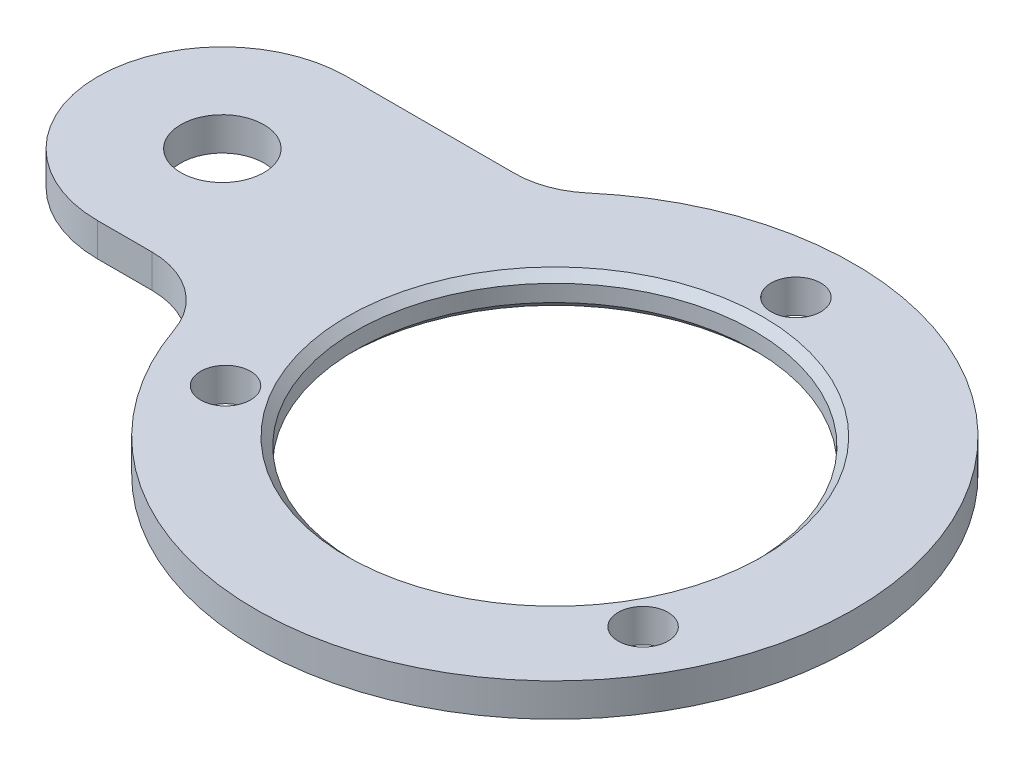
ISO-10303-21;
HEADER;
FILE_DESCRIPTION(('STEP AP214'),'2;1');
FILE_NAME('part.step','',(''),(''),'','','');
FILE_SCHEMA(('AUTOMOTIVE_DESIGN { 1 0 10303 214 1 1 1 1 }'));
ENDSEC;
DATA;
#1=APPLICATION_CONTEXT('core data for automotive mechanical design processes');
#2=APPLICATION_PROTOCOL_DEFINITION('international standard','automotive_design',2000,#1);
#3=PRODUCT_CONTEXT('',#1,'mechanical');
#4=PRODUCT('Part','Part','',(#3));
#5=PRODUCT_RELATED_PRODUCT_CATEGORY('part','',(#4));
#6=PRODUCT_DEFINITION_FORMATION('','',#4);
#7=PRODUCT_DEFINITION_CONTEXT('part definition',#1,'design');
#8=PRODUCT_DEFINITION('design','',#6,#7);
#9=PRODUCT_DEFINITION_SHAPE('','',#8);
#10=(LENGTH_UNIT() NAMED_UNIT(*) SI_UNIT(.MILLI.,.METRE.));
#11=(NAMED_UNIT(*) PLANE_ANGLE_UNIT() SI_UNIT($,.RADIAN.));
#12=(NAMED_UNIT(*) SI_UNIT($,.STERADIAN.) SOLID_ANGLE_UNIT());
#13=UNCERTAINTY_MEASURE_WITH_UNIT(LENGTH_MEASURE(1.E-05),#10,'distance_accuracy_value','');
#14=(GEOMETRIC_REPRESENTATION_CONTEXT(3) GLOBAL_UNCERTAINTY_ASSIGNED_CONTEXT((#13)) GLOBAL_UNIT_ASSIGNED_CONTEXT((#10,
#11,#12)) REPRESENTATION_CONTEXT('',''));
#15=CARTESIAN_POINT('',(0.,0.,0.));
#16=DIRECTION('',(0.,0.,1.));
#17=DIRECTION('',(1.,0.,0.));
#18=AXIS2_PLACEMENT_3D('',#15,#16,#17);
#19=CARTESIAN_POINT('',(-14.9248115565993,2.,-17.5));
#20=DIRECTION('',(0.,-1.,0.));
#21=DIRECTION('',(0.,0.,-1.));
#22=AXIS2_PLACEMENT_3D('',#19,#20,#21);
#23=PLANE('',#22);
#24=CARTESIAN_POINT('',(0.,2.,0.));
#25=DIRECTION('',(0.,-1.,0.));
#26=DIRECTION('',(0.,0.,-1.));
#27=AXIS2_PLACEMENT_3D('',#24,#25,#26);
#28=CIRCLE('',#27,12.5);
#29=CARTESIAN_POINT('',(0.,2.,-12.5));
#30=VERTEX_POINT('',#29);
#31=EDGE_CURVE('E40',#30,#30,#28,.T.);
#32=ORIENTED_EDGE('',*,*,#31,.T.);
#33=EDGE_LOOP('',(#32));
#34=FACE_BOUND('',#33,.T.);
#35=CARTESIAN_POINT('',(0.,2.,-14.5));
#36=DIRECTION('',(0.,1.,0.));
#37=DIRECTION('',(0.,0.,1.));
#38=AXIS2_PLACEMENT_3D('',#35,#36,#37);
#39=CIRCLE('',#38,1.5);
#40=CARTESIAN_POINT('',(0.,2.,-13.));
#41=VERTEX_POINT('',#40);
#42=EDGE_CURVE('E193',#41,#41,#39,.T.);
#43=ORIENTED_EDGE('',*,*,#42,.F.);
#44=EDGE_LOOP('',(#43));
#45=FACE_BOUND('',#44,.T.);
#46=CARTESIAN_POINT('',(-12.5573683548744,2.,7.24999999999989));
#47=DIRECTION('',(0.,1.,0.));
#48=DIRECTION('',(0.,0.,1.));
#49=AXIS2_PLACEMENT_3D('',#46,#47,#48);
#50=CIRCLE('',#49,1.5);
#51=CARTESIAN_POINT('',(-12.5573683548744,2.,8.74999999999989));
#52=VERTEX_POINT('',#51);
#53=EDGE_CURVE('E121',#52,#52,#50,.T.);
#54=ORIENTED_EDGE('',*,*,#53,.F.);
#55=EDGE_LOOP('',(#54));
#56=FACE_BOUND('',#55,.T.);
#57=CARTESIAN_POINT('',(-14.9248115565993,2.,-17.5));
#58=DIRECTION('',(0.,-1.,0.));
#59=DIRECTION('',(0.,0.,-1.));
#60=AXIS2_PLACEMENT_3D('',#57,#58,#59);
#61=CIRCLE('',#60,5.);
#62=CARTESIAN_POINT('',(-11.6802873051647,2.,-13.695652173913));
#63=VERTEX_POINT('',#62);
#64=CARTESIAN_POINT('',(-14.9248115565993,2.,-12.5));
#65=VERTEX_POINT('',#64);
#66=EDGE_CURVE('E128',#63,#65,#61,.T.);
#67=ORIENTED_EDGE('',*,*,#66,.T.);
#68=DIRECTION('',(-1.,0.,0.));
#69=VECTOR('',#68,1.);
#70=CARTESIAN_POINT('',(-25.,2.,-12.5));
#71=LINE('',#70,#69);
#72=CARTESIAN_POINT('',(-25.,2.,-12.5));
#73=VERTEX_POINT('',#72);
#74=EDGE_CURVE('E86',#65,#73,#71,.T.);
#75=ORIENTED_EDGE('',*,*,#74,.T.);
#76=CARTESIAN_POINT('',(-25.,2.,-5.));
#77=DIRECTION('',(0.,1.,0.));
#78=DIRECTION('',(0.,0.,-1.));
#79=AXIS2_PLACEMENT_3D('',#76,#77,#78);
#80=CIRCLE('',#79,7.5);
#81=CARTESIAN_POINT('',(-25.,2.,2.5));
#82=VERTEX_POINT('',#81);
#83=EDGE_CURVE('E99',#73,#82,#80,.T.);
#84=ORIENTED_EDGE('',*,*,#83,.T.);
#85=DIRECTION('',(1.,0.,0.));
#86=VECTOR('',#85,1.);
#87=CARTESIAN_POINT('',(-25.,2.,2.5));
#88=LINE('',#87,#86);
#89=CARTESIAN_POINT('',(-21.7428149051589,2.,2.5));
#90=VERTEX_POINT('',#89);
#91=EDGE_CURVE('E93',#82,#90,#88,.T.);
#92=ORIENTED_EDGE('',*,*,#91,.T.);
#93=CARTESIAN_POINT('',(-21.7428149051589,2.,7.5));
#94=DIRECTION('',(0.,-1.,0.));
#95=DIRECTION('',(0.,0.,1.));
#96=AXIS2_PLACEMENT_3D('',#93,#94,#95);
#97=CIRCLE('',#96,5.);
#98=CARTESIAN_POINT('',(-17.0161160127331,2.,5.86956521739131));
#99=VERTEX_POINT('',#98);
#100=EDGE_CURVE('E97',#90,#99,#97,.T.);
#101=ORIENTED_EDGE('',*,*,#100,.T.);
#102=CARTESIAN_POINT('',(0.,2.,0.));
#103=DIRECTION('',(0.,1.,0.));
#104=DIRECTION('',(0.,0.,1.));
#105=AXIS2_PLACEMENT_3D('',#102,#103,#104);
#106=CIRCLE('',#105,18.);
#107=EDGE_CURVE('E48',#99,#63,#106,.T.);
#108=ORIENTED_EDGE('',*,*,#107,.T.);
#109=EDGE_LOOP('',(#67,#75,#84,#92,#101,#108));
#110=FACE_BOUND('',#109,.T.);
#111=CARTESIAN_POINT('',(12.5573683548744,2.,7.24999999999994));
#112=DIRECTION('',(0.,1.,0.));
#113=DIRECTION('',(0.,0.,1.));
#114=AXIS2_PLACEMENT_3D('',#111,#112,#113);
#115=CIRCLE('',#114,1.4999999999999);
#116=CARTESIAN_POINT('',(12.5573683548744,2.,8.74999999999984));
#117=VERTEX_POINT('',#116);
#118=EDGE_CURVE('E197',#117,#117,#115,.T.);
#119=ORIENTED_EDGE('',*,*,#118,.F.);
#120=EDGE_LOOP('',(#119));
#121=FACE_BOUND('',#120,.T.);
#122=CARTESIAN_POINT('',(-25.,2.,-5.));
#123=DIRECTION('',(0.,1.,0.));
#124=DIRECTION('',(0.,0.,-1.));
#125=AXIS2_PLACEMENT_3D('',#122,#123,#124);
#126=CIRCLE('',#125,2.5);
#127=CARTESIAN_POINT('',(-25.,2.,-7.5));
#128=VERTEX_POINT('',#127);
#129=EDGE_CURVE('E188',#128,#128,#126,.T.);
#130=ORIENTED_EDGE('',*,*,#129,.F.);
#131=EDGE_LOOP('',(#130));
#132=FACE_BOUND('',#131,.T.);
#133=ADVANCED_FACE('F31',(#34,#45,#56,#110,#121,#132),#23,.F.);
#134=CARTESIAN_POINT('',(-14.9248115565993,0.,-17.5));
#135=DIRECTION('',(0.,-1.,0.));
#136=DIRECTION('',(0.,0.,-1.));
#137=AXIS2_PLACEMENT_3D('',#134,#135,#136);
#138=PLANE('',#137);
#139=CARTESIAN_POINT('',(0.,0.,0.));
#140=DIRECTION('',(0.,-1.,0.));
#141=DIRECTION('',(0.,0.,-1.));
#142=AXIS2_PLACEMENT_3D('',#139,#140,#141);
#143=CIRCLE('',#142,12.5);
#144=CARTESIAN_POINT('',(0.,0.,-12.5));
#145=VERTEX_POINT('',#144);
#146=EDGE_CURVE('E11',#145,#145,#143,.F.);
#147=ORIENTED_EDGE('',*,*,#146,.T.);
#148=EDGE_LOOP('',(#147));
#149=FACE_BOUND('',#148,.T.);
#150=CARTESIAN_POINT('',(0.,0.,-14.5));
#151=DIRECTION('',(0.,1.,0.));
#152=DIRECTION('',(0.,0.,1.));
#153=AXIS2_PLACEMENT_3D('',#150,#151,#152);
#154=CIRCLE('',#153,1.5);
#155=CARTESIAN_POINT('',(0.,0.,-13.));
#156=VERTEX_POINT('',#155);
#157=EDGE_CURVE('E173',#156,#156,#154,.T.);
#158=ORIENTED_EDGE('',*,*,#157,.T.);
#159=EDGE_LOOP('',(#158));
#160=FACE_BOUND('',#159,.T.);
#161=CARTESIAN_POINT('',(-12.5573683548744,0.,7.24999999999989));
#162=DIRECTION('',(0.,1.,0.));
#163=DIRECTION('',(0.,0.,1.));
#164=AXIS2_PLACEMENT_3D('',#161,#162,#163);
#165=CIRCLE('',#164,1.5);
#166=CARTESIAN_POINT('',(-12.5573683548744,0.,8.74999999999989));
#167=VERTEX_POINT('',#166);
#168=EDGE_CURVE('E177',#167,#167,#165,.T.);
#169=ORIENTED_EDGE('',*,*,#168,.T.);
#170=EDGE_LOOP('',(#169));
#171=FACE_BOUND('',#170,.T.);
#172=CARTESIAN_POINT('',(-14.9248115565993,0.,-17.5));
#173=DIRECTION('',(0.,-1.,0.));
#174=DIRECTION('',(0.,0.,-1.));
#175=AXIS2_PLACEMENT_3D('',#172,#173,#174);
#176=CIRCLE('',#175,5.);
#177=CARTESIAN_POINT('',(-11.6802873051647,0.,-13.695652173913));
#178=VERTEX_POINT('',#177);
#179=CARTESIAN_POINT('',(-14.9248115565993,0.,-12.5));
#180=VERTEX_POINT('',#179);
#181=EDGE_CURVE('E117',#178,#180,#176,.T.);
#182=ORIENTED_EDGE('',*,*,#181,.F.);
#183=CARTESIAN_POINT('',(0.,0.,0.));
#184=DIRECTION('',(0.,1.,0.));
#185=DIRECTION('',(0.,0.,1.));
#186=AXIS2_PLACEMENT_3D('',#183,#184,#185);
#187=CIRCLE('',#186,18.);
#188=CARTESIAN_POINT('',(-17.0161160127331,0.,5.86956521739131));
#189=VERTEX_POINT('',#188);
#190=EDGE_CURVE('E77',#189,#178,#187,.T.);
#191=ORIENTED_EDGE('',*,*,#190,.F.);
#192=CARTESIAN_POINT('',(-21.7428149051589,0.,7.5));
#193=DIRECTION('',(0.,-1.,0.));
#194=DIRECTION('',(0.,0.,1.));
#195=AXIS2_PLACEMENT_3D('',#192,#193,#194);
#196=CIRCLE('',#195,5.);
#197=CARTESIAN_POINT('',(-21.7428149051589,0.,2.5));
#198=VERTEX_POINT('',#197);
#199=EDGE_CURVE('E71',#198,#189,#196,.T.);
#200=ORIENTED_EDGE('',*,*,#199,.F.);
#201=DIRECTION('',(1.,0.,0.));
#202=VECTOR('',#201,1.);
#203=CARTESIAN_POINT('',(-25.,0.,2.5));
#204=LINE('',#203,#202);
#205=CARTESIAN_POINT('',(-25.,0.,2.5));
#206=VERTEX_POINT('',#205);
#207=EDGE_CURVE('E107',#206,#198,#204,.T.);
#208=ORIENTED_EDGE('',*,*,#207,.F.);
#209=CARTESIAN_POINT('',(-25.,0.,-5.));
#210=DIRECTION('',(0.,1.,0.));
#211=DIRECTION('',(0.,0.,-1.));
#212=AXIS2_PLACEMENT_3D('',#209,#210,#211);
#213=CIRCLE('',#212,7.5);
#214=CARTESIAN_POINT('',(-25.,0.,-12.5));
#215=VERTEX_POINT('',#214);
#216=EDGE_CURVE('E123',#215,#206,#213,.T.);
#217=ORIENTED_EDGE('',*,*,#216,.F.);
#218=DIRECTION('',(-1.,0.,0.));
#219=VECTOR('',#218,1.);
#220=CARTESIAN_POINT('',(-25.,0.,-12.5));
#221=LINE('',#220,#219);
#222=EDGE_CURVE('E120',#180,#215,#221,.T.);
#223=ORIENTED_EDGE('',*,*,#222,.F.);
#224=EDGE_LOOP('',(#182,#191,#200,#208,#217,#223));
#225=FACE_BOUND('',#224,.T.);
#226=CARTESIAN_POINT('',(12.5573683548744,0.,7.24999999999994));
#227=DIRECTION('',(0.,1.,0.));
#228=DIRECTION('',(0.,0.,1.));
#229=AXIS2_PLACEMENT_3D('',#226,#227,#228);
#230=CIRCLE('',#229,1.4999999999999);
#231=CARTESIAN_POINT('',(12.5573683548744,0.,8.74999999999984));
#232=VERTEX_POINT('',#231);
#233=EDGE_CURVE('E183',#232,#232,#230,.T.);
#234=ORIENTED_EDGE('',*,*,#233,.T.);
#235=EDGE_LOOP('',(#234));
#236=FACE_BOUND('',#235,.T.);
#237=CARTESIAN_POINT('',(-25.,0.,-5.));
#238=DIRECTION('',(0.,1.,0.));
#239=DIRECTION('',(0.,0.,-1.));
#240=AXIS2_PLACEMENT_3D('',#237,#238,#239);
#241=CIRCLE('',#240,2.5);
#242=CARTESIAN_POINT('',(-25.,0.,-7.5));
#243=VERTEX_POINT('',#242);
#244=EDGE_CURVE('E186',#243,#243,#241,.T.);
#245=ORIENTED_EDGE('',*,*,#244,.T.);
#246=EDGE_LOOP('',(#245));
#247=FACE_BOUND('',#246,.T.);
#248=ADVANCED_FACE('F165',(#149,#160,#171,#225,#236,#247),#138,.T.);
#249=CARTESIAN_POINT('',(-14.9248115565993,2.,-17.5));
#250=DIRECTION('',(0.,-1.,0.));
#251=DIRECTION('',(0.,0.,-1.));
#252=AXIS2_PLACEMENT_3D('',#249,#250,#251);
#253=CYLINDRICAL_SURFACE('',#252,5.);
#254=ORIENTED_EDGE('',*,*,#181,.T.);
#255=DIRECTION('',(0.,-1.,0.));
#256=VECTOR('',#255,1.);
#257=CARTESIAN_POINT('',(-14.9248115565993,2.,-12.5));
#258=LINE('',#257,#256);
#259=EDGE_CURVE('E135',#65,#180,#258,.T.);
#260=ORIENTED_EDGE('',*,*,#259,.F.);
#261=ORIENTED_EDGE('',*,*,#66,.F.);
#262=DIRECTION('',(0.,-1.,0.));
#263=VECTOR('',#262,1.);
#264=CARTESIAN_POINT('',(-11.6802873051647,2.,-13.695652173913));
#265=LINE('',#264,#263);
#266=EDGE_CURVE('E113',#63,#178,#265,.T.);
#267=ORIENTED_EDGE('',*,*,#266,.T.);
#268=EDGE_LOOP('',(#254,#260,#261,#267));
#269=FACE_BOUND('',#268,.T.);
#270=ADVANCED_FACE('F168',(#269),#253,.F.);
#271=CARTESIAN_POINT('',(-25.,2.,-12.5));
#272=DIRECTION('',(0.,0.,1.));
#273=DIRECTION('',(1.,0.,0.));
#274=AXIS2_PLACEMENT_3D('',#271,#272,#273);
#275=PLANE('',#274);
#276=ORIENTED_EDGE('',*,*,#222,.T.);
#277=DIRECTION('',(0.,-1.,0.));
#278=VECTOR('',#277,1.);
#279=CARTESIAN_POINT('',(-25.,2.,-12.5));
#280=LINE('',#279,#278);
#281=EDGE_CURVE('E132',#73,#215,#280,.T.);
#282=ORIENTED_EDGE('',*,*,#281,.F.);
#283=ORIENTED_EDGE('',*,*,#74,.F.);
#284=ORIENTED_EDGE('',*,*,#259,.T.);
#285=EDGE_LOOP('',(#276,#282,#283,#284));
#286=FACE_BOUND('',#285,.T.);
#287=ADVANCED_FACE('F207',(#286),#275,.F.);
#288=CARTESIAN_POINT('',(-25.,2.,-5.));
#289=DIRECTION('',(0.,-1.,0.));
#290=DIRECTION('',(0.,0.,-1.));
#291=AXIS2_PLACEMENT_3D('',#288,#289,#290);
#292=CYLINDRICAL_SURFACE('',#291,7.5);
#293=ORIENTED_EDGE('',*,*,#216,.T.);
#294=DIRECTION('',(0.,-1.,0.));
#295=VECTOR('',#294,1.);
#296=CARTESIAN_POINT('',(-25.,2.,2.5));
#297=LINE('',#296,#295);
#298=EDGE_CURVE('E108',#82,#206,#297,.T.);
#299=ORIENTED_EDGE('',*,*,#298,.F.);
#300=ORIENTED_EDGE('',*,*,#83,.F.);
#301=ORIENTED_EDGE('',*,*,#281,.T.);
#302=EDGE_LOOP('',(#293,#299,#300,#301));
#303=FACE_BOUND('',#302,.T.);
#304=ADVANCED_FACE('F210',(#303),#292,.T.);
#305=CARTESIAN_POINT('',(-25.,2.,2.5));
#306=DIRECTION('',(0.,0.,-1.));
#307=DIRECTION('',(-1.,0.,0.));
#308=AXIS2_PLACEMENT_3D('',#305,#306,#307);
#309=PLANE('',#308);
#310=ORIENTED_EDGE('',*,*,#207,.T.);
#311=DIRECTION('',(0.,-1.,0.));
#312=VECTOR('',#311,1.);
#313=CARTESIAN_POINT('',(-21.7428149051589,2.,2.5));
#314=LINE('',#313,#312);
#315=EDGE_CURVE('E104',#90,#198,#314,.T.);
#316=ORIENTED_EDGE('',*,*,#315,.F.);
#317=ORIENTED_EDGE('',*,*,#91,.F.);
#318=ORIENTED_EDGE('',*,*,#298,.T.);
#319=EDGE_LOOP('',(#310,#316,#317,#318));
#320=FACE_BOUND('',#319,.T.);
#321=ADVANCED_FACE('F105',(#320),#309,.F.);
#322=CARTESIAN_POINT('',(-21.7428149051589,2.,7.5));
#323=DIRECTION('',(0.,-1.,0.));
#324=DIRECTION('',(0.,0.,-1.));
#325=AXIS2_PLACEMENT_3D('',#322,#323,#324);
#326=CYLINDRICAL_SURFACE('',#325,5.);
#327=ORIENTED_EDGE('',*,*,#199,.T.);
#328=DIRECTION('',(0.,-1.,0.));
#329=VECTOR('',#328,1.);
#330=CARTESIAN_POINT('',(-17.0161160127331,2.,5.86956521739131));
#331=LINE('',#330,#329);
#332=EDGE_CURVE('E109',#99,#189,#331,.T.);
#333=ORIENTED_EDGE('',*,*,#332,.F.);
#334=ORIENTED_EDGE('',*,*,#100,.F.);
#335=ORIENTED_EDGE('',*,*,#315,.T.);
#336=EDGE_LOOP('',(#327,#333,#334,#335));
#337=FACE_BOUND('',#336,.T.);
#338=ADVANCED_FACE('F111',(#337),#326,.F.);
#339=CARTESIAN_POINT('',(0.,2.,0.));
#340=DIRECTION('',(0.,-1.,0.));
#341=DIRECTION('',(0.,0.,-1.));
#342=AXIS2_PLACEMENT_3D('',#339,#340,#341);
#343=CYLINDRICAL_SURFACE('',#342,18.);
#344=ORIENTED_EDGE('',*,*,#190,.T.);
#345=ORIENTED_EDGE('',*,*,#266,.F.);
#346=ORIENTED_EDGE('',*,*,#107,.F.);
#347=ORIENTED_EDGE('',*,*,#332,.T.);
#348=EDGE_LOOP('',(#344,#345,#346,#347));
#349=FACE_BOUND('',#348,.T.);
#350=ADVANCED_FACE('F157',(#349),#343,.T.);
#351=CARTESIAN_POINT('',(0.,2.,0.));
#352=DIRECTION('',(0.,-1.,0.));
#353=DIRECTION('',(0.,0.,-1.));
#354=AXIS2_PLACEMENT_3D('',#351,#352,#353);
#355=CYLINDRICAL_SURFACE('',#354,12.);
#356=CARTESIAN_POINT('',(0.,1.5,0.));
#357=DIRECTION('',(0.,-1.,0.));
#358=DIRECTION('',(0.,0.,-1.));
#359=AXIS2_PLACEMENT_3D('',#356,#357,#358);
#360=CIRCLE('',#359,12.);
#361=CARTESIAN_POINT('',(0.,1.5,-12.));
#362=VERTEX_POINT('',#361);
#363=EDGE_CURVE('E140',#362,#362,#360,.F.);
#364=ORIENTED_EDGE('',*,*,#363,.T.);
#365=EDGE_LOOP('',(#364));
#366=FACE_BOUND('',#365,.T.);
#367=CARTESIAN_POINT('',(0.,0.499999999999995,0.));
#368=DIRECTION('',(0.,-1.,0.));
#369=DIRECTION('',(0.,0.,-1.));
#370=AXIS2_PLACEMENT_3D('',#367,#368,#369);
#371=CIRCLE('',#370,12.);
#372=CARTESIAN_POINT('',(0.,0.499999999999995,-12.));
#373=VERTEX_POINT('',#372);
#374=EDGE_CURVE('E137',#373,#373,#371,.T.);
#375=ORIENTED_EDGE('',*,*,#374,.T.);
#376=EDGE_LOOP('',(#375));
#377=FACE_BOUND('',#376,.T.);
#378=ADVANCED_FACE('F153',(#366,#377),#355,.F.);
#379=CARTESIAN_POINT('',(-12.5573683548744,2.,7.24999999999989));
#380=DIRECTION('',(0.,-1.,0.));
#381=DIRECTION('',(0.,0.,-1.));
#382=AXIS2_PLACEMENT_3D('',#379,#380,#381);
#383=CYLINDRICAL_SURFACE('',#382,1.5);
#384=ORIENTED_EDGE('',*,*,#53,.T.);
#385=EDGE_LOOP('',(#384));
#386=FACE_BOUND('',#385,.T.);
#387=ORIENTED_EDGE('',*,*,#168,.F.);
#388=EDGE_LOOP('',(#387));
#389=FACE_BOUND('',#388,.T.);
#390=ADVANCED_FACE('F156',(#386,#389),#383,.F.);
#391=CARTESIAN_POINT('',(12.5573683548744,2.,7.24999999999994));
#392=DIRECTION('',(0.,-1.,0.));
#393=DIRECTION('',(0.,0.,-1.));
#394=AXIS2_PLACEMENT_3D('',#391,#392,#393);
#395=CYLINDRICAL_SURFACE('',#394,1.4999999999999);
#396=ORIENTED_EDGE('',*,*,#118,.T.);
#397=EDGE_LOOP('',(#396));
#398=FACE_BOUND('',#397,.T.);
#399=ORIENTED_EDGE('',*,*,#233,.F.);
#400=EDGE_LOOP('',(#399));
#401=FACE_BOUND('',#400,.T.);
#402=ADVANCED_FACE('F225',(#398,#401),#395,.F.);
#403=CARTESIAN_POINT('',(0.,2.,-14.5));
#404=DIRECTION('',(0.,-1.,0.));
#405=DIRECTION('',(0.,0.,-1.));
#406=AXIS2_PLACEMENT_3D('',#403,#404,#405);
#407=CYLINDRICAL_SURFACE('',#406,1.5);
#408=ORIENTED_EDGE('',*,*,#42,.T.);
#409=EDGE_LOOP('',(#408));
#410=FACE_BOUND('',#409,.T.);
#411=ORIENTED_EDGE('',*,*,#157,.F.);
#412=EDGE_LOOP('',(#411));
#413=FACE_BOUND('',#412,.T.);
#414=ADVANCED_FACE('F229',(#410,#413),#407,.F.);
#415=CARTESIAN_POINT('',(-25.,2.,-5.));
#416=DIRECTION('',(0.,-1.,0.));
#417=DIRECTION('',(0.,0.,-1.));
#418=AXIS2_PLACEMENT_3D('',#415,#416,#417);
#419=CYLINDRICAL_SURFACE('',#418,2.5);
#420=ORIENTED_EDGE('',*,*,#129,.T.);
#421=EDGE_LOOP('',(#420));
#422=FACE_BOUND('',#421,.T.);
#423=ORIENTED_EDGE('',*,*,#244,.F.);
#424=EDGE_LOOP('',(#423));
#425=FACE_BOUND('',#424,.T.);
#426=ADVANCED_FACE('F150',(#422,#425),#419,.F.);
#427=CARTESIAN_POINT('',(0.,1.5,0.));
#428=DIRECTION('',(0.,1.,0.));
#429=DIRECTION('',(0.,0.,1.));
#430=AXIS2_PLACEMENT_3D('',#427,#428,#429);
#431=CONICAL_SURFACE('',#430,12.,0.785398163397457);
#432=ORIENTED_EDGE('',*,*,#31,.F.);
#433=EDGE_LOOP('',(#432));
#434=FACE_BOUND('',#433,.T.);
#435=ORIENTED_EDGE('',*,*,#363,.F.);
#436=EDGE_LOOP('',(#435));
#437=FACE_BOUND('',#436,.T.);
#438=ADVANCED_FACE('F147',(#434,#437),#431,.F.);
#439=CARTESIAN_POINT('',(0.,0.,0.));
#440=DIRECTION('',(0.,-1.,0.));
#441=DIRECTION('',(0.,0.,-1.));
#442=AXIS2_PLACEMENT_3D('',#439,#440,#441);
#443=CONICAL_SURFACE('',#442,12.5,0.785398163397448);
#444=ORIENTED_EDGE('',*,*,#374,.F.);
#445=EDGE_LOOP('',(#444));
#446=FACE_BOUND('',#445,.T.);
#447=ORIENTED_EDGE('',*,*,#146,.F.);
#448=EDGE_LOOP('',(#447));
#449=FACE_BOUND('',#448,.T.);
#450=ADVANCED_FACE('F33',(#446,#449),#443,.F.);
#451=CLOSED_SHELL('',(#133,#248,#270,#287,#304,#321,#338,#350,#378,#390,#402,#414,#426,#438,#450));
#452=MANIFOLD_SOLID_BREP('B2',#451);
#453=ADVANCED_BREP_SHAPE_REPRESENTATION('',(#18,#452),#14);
#454=SHAPE_DEFINITION_REPRESENTATION(#9,#453);
ENDSEC;
END-ISO-10303-21;
